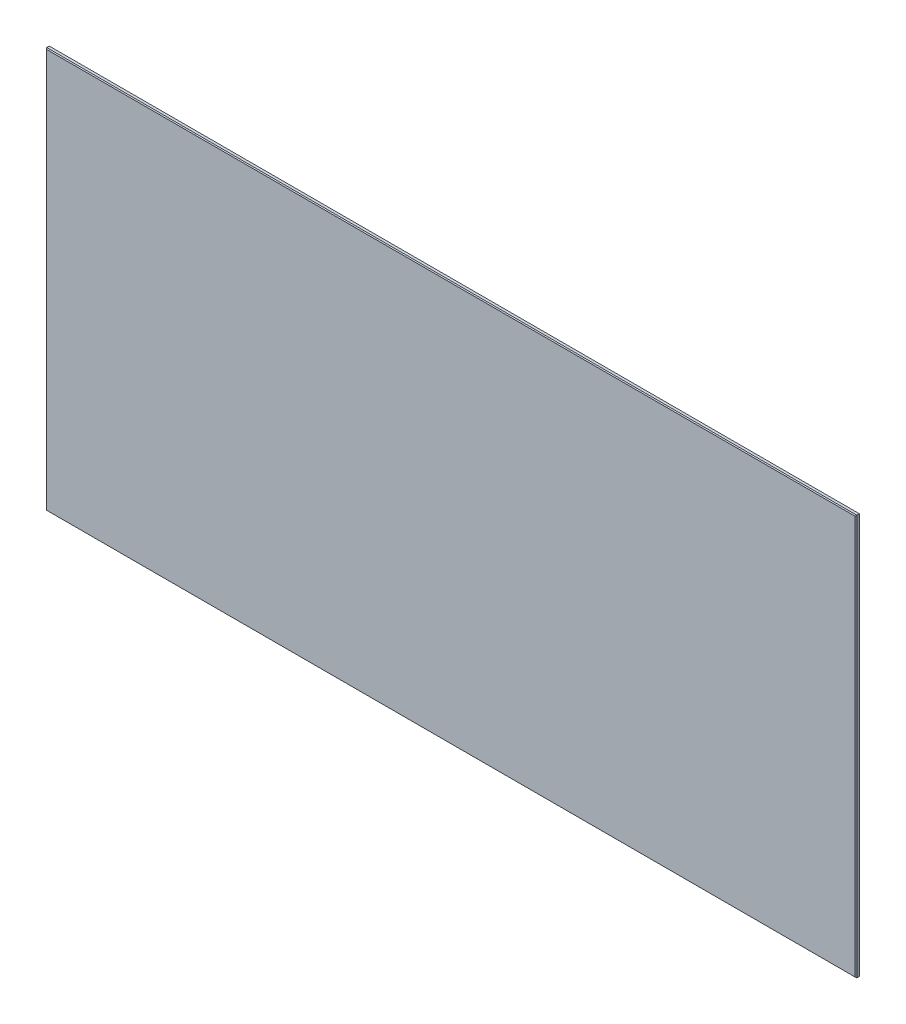
ISO-10303-21;
HEADER;
FILE_DESCRIPTION(('STEP AP214'),'2;1');
FILE_NAME('part.step','',(''),(''),'','','');
FILE_SCHEMA(('AUTOMOTIVE_DESIGN { 1 0 10303 214 1 1 1 1 }'));
ENDSEC;
DATA;
#1=APPLICATION_CONTEXT('core data for automotive mechanical design processes');
#2=APPLICATION_PROTOCOL_DEFINITION('international standard','automotive_design',2000,#1);
#3=PRODUCT_CONTEXT('',#1,'mechanical');
#4=PRODUCT('Part','Part','',(#3));
#5=PRODUCT_RELATED_PRODUCT_CATEGORY('part','',(#4));
#6=PRODUCT_DEFINITION_FORMATION('','',#4);
#7=PRODUCT_DEFINITION_CONTEXT('part definition',#1,'design');
#8=PRODUCT_DEFINITION('design','',#6,#7);
#9=PRODUCT_DEFINITION_SHAPE('','',#8);
#10=(LENGTH_UNIT() NAMED_UNIT(*) SI_UNIT(.MILLI.,.METRE.));
#11=(NAMED_UNIT(*) PLANE_ANGLE_UNIT() SI_UNIT($,.RADIAN.));
#12=(NAMED_UNIT(*) SI_UNIT($,.STERADIAN.) SOLID_ANGLE_UNIT());
#13=UNCERTAINTY_MEASURE_WITH_UNIT(LENGTH_MEASURE(1.E-05),#10,'distance_accuracy_value','');
#14=(GEOMETRIC_REPRESENTATION_CONTEXT(3) GLOBAL_UNCERTAINTY_ASSIGNED_CONTEXT((#13)) GLOBAL_UNIT_ASSIGNED_CONTEXT((#10,
#11,#12)) REPRESENTATION_CONTEXT('',''));
#15=CARTESIAN_POINT('',(0.,0.,0.));
#16=DIRECTION('',(0.,0.,1.));
#17=DIRECTION('',(1.,0.,0.));
#18=AXIS2_PLACEMENT_3D('',#15,#16,#17);
#19=CARTESIAN_POINT('',(603.25,298.45,1.905));
#20=DIRECTION('',(0.,-0.707106781186549,-0.707106781186545));
#21=DIRECTION('',(0.,0.707106781186546,-0.70710678118655));
#22=AXIS2_PLACEMENT_3D('',#19,#20,#21);
#23=PLANE('',#22);
#24=DIRECTION('',(-1.,0.,0.));
#25=VECTOR('',#24,1.);
#26=CARTESIAN_POINT('',(603.25,298.45,1.905));
#27=LINE('',#26,#25);
#28=CARTESIAN_POINT('',(603.25,298.45,1.905));
#29=VERTEX_POINT('',#28);
#30=CARTESIAN_POINT('',(-603.25,298.45,1.905));
#31=VERTEX_POINT('',#30);
#32=EDGE_CURVE('E203',#29,#31,#27,.T.);
#33=ORIENTED_EDGE('',*,*,#32,.T.);
#34=DIRECTION('',(-0.57735026918966,0.577350269189607,-0.57735026918961));
#35=VECTOR('',#34,1.);
#36=CARTESIAN_POINT('',(-601.98,297.18,3.175));
#37=LINE('',#36,#35);
#38=CARTESIAN_POINT('',(-601.98,297.18,3.175));
#39=VERTEX_POINT('',#38);
#40=EDGE_CURVE('E135',#31,#39,#37,.F.);
#41=ORIENTED_EDGE('',*,*,#40,.T.);
#42=DIRECTION('',(-1.,0.,0.));
#43=VECTOR('',#42,1.);
#44=CARTESIAN_POINT('',(603.25,297.18,3.175));
#45=LINE('',#44,#43);
#46=CARTESIAN_POINT('',(601.98,297.18,3.175));
#47=VERTEX_POINT('',#46);
#48=EDGE_CURVE('E168',#47,#39,#45,.T.);
#49=ORIENTED_EDGE('',*,*,#48,.F.);
#50=DIRECTION('',(0.577350269189627,0.577350269189624,-0.577350269189627));
#51=VECTOR('',#50,1.);
#52=CARTESIAN_POINT('',(503.766666666667,198.966666666667,101.388333333333));
#53=LINE('',#52,#51);
#54=EDGE_CURVE('E110',#47,#29,#53,.T.);
#55=ORIENTED_EDGE('',*,*,#54,.T.);
#56=EDGE_LOOP('',(#33,#41,#49,#55));
#57=FACE_BOUND('',#56,.T.);
#58=ADVANCED_FACE('F40',(#57),#23,.F.);
#59=CARTESIAN_POINT('',(603.25,297.18,3.175));
#60=DIRECTION('',(0.,0.,-1.));
#61=DIRECTION('',(-1.,0.,0.));
#62=AXIS2_PLACEMENT_3D('',#59,#60,#61);
#63=PLANE('',#62);
#64=ORIENTED_EDGE('',*,*,#48,.T.);
#65=DIRECTION('',(0.,-1.,0.));
#66=VECTOR('',#65,1.);
#67=CARTESIAN_POINT('',(-601.98,297.18,3.175));
#68=LINE('',#67,#66);
#69=CARTESIAN_POINT('',(-601.98,-297.18,3.175));
#70=VERTEX_POINT('',#69);
#71=EDGE_CURVE('E149',#39,#70,#68,.T.);
#72=ORIENTED_EDGE('',*,*,#71,.T.);
#73=DIRECTION('',(-1.,0.,0.));
#74=VECTOR('',#73,1.);
#75=CARTESIAN_POINT('',(603.25,-297.18,3.175));
#76=LINE('',#75,#74);
#77=CARTESIAN_POINT('',(601.98,-297.18,3.175));
#78=VERTEX_POINT('',#77);
#79=EDGE_CURVE('E109',#78,#70,#76,.T.);
#80=ORIENTED_EDGE('',*,*,#79,.F.);
#81=DIRECTION('',(0.,1.,0.));
#82=VECTOR('',#81,1.);
#83=CARTESIAN_POINT('',(601.98,297.18,3.175));
#84=LINE('',#83,#82);
#85=EDGE_CURVE('E147',#78,#47,#84,.T.);
#86=ORIENTED_EDGE('',*,*,#85,.T.);
#87=EDGE_LOOP('',(#64,#72,#80,#86));
#88=FACE_BOUND('',#87,.T.);
#89=ADVANCED_FACE('F167',(#88),#63,.F.);
#90=CARTESIAN_POINT('',(603.25,-297.18,3.175));
#91=DIRECTION('',(0.,0.707106781186565,-0.70710678118653));
#92=DIRECTION('',(0.,0.70710678118653,0.707106781186565));
#93=AXIS2_PLACEMENT_3D('',#90,#91,#92);
#94=PLANE('',#93);
#95=ORIENTED_EDGE('',*,*,#79,.T.);
#96=DIRECTION('',(0.577350269189669,0.57735026918959,0.577350269189618));
#97=VECTOR('',#96,1.);
#98=CARTESIAN_POINT('',(-403.859999999997,-99.0600000000244,201.294999999985));
#99=LINE('',#98,#97);
#100=CARTESIAN_POINT('',(-603.25,-298.45,1.905));
#101=VERTEX_POINT('',#100);
#102=EDGE_CURVE('E56',#70,#101,#99,.F.);
#103=ORIENTED_EDGE('',*,*,#102,.T.);
#104=DIRECTION('',(-1.,0.,0.));
#105=VECTOR('',#104,1.);
#106=CARTESIAN_POINT('',(603.25,-298.45,1.905));
#107=LINE('',#106,#105);
#108=CARTESIAN_POINT('',(603.25,-298.45,1.905));
#109=VERTEX_POINT('',#108);
#110=EDGE_CURVE('E107',#109,#101,#107,.T.);
#111=ORIENTED_EDGE('',*,*,#110,.F.);
#112=DIRECTION('',(-0.577350269189635,0.577350269189607,0.577350269189635));
#113=VECTOR('',#112,1.);
#114=CARTESIAN_POINT('',(503.766666666669,-198.966666666673,101.388333333332));
#115=LINE('',#114,#113);
#116=EDGE_CURVE('E64',#109,#78,#115,.T.);
#117=ORIENTED_EDGE('',*,*,#116,.T.);
#118=EDGE_LOOP('',(#95,#103,#111,#117));
#119=FACE_BOUND('',#118,.T.);
#120=ADVANCED_FACE('F106',(#119),#94,.F.);
#121=CARTESIAN_POINT('',(603.25,-298.45,1.905));
#122=DIRECTION('',(0.,1.,0.));
#123=DIRECTION('',(0.,0.,1.));
#124=AXIS2_PLACEMENT_3D('',#121,#122,#123);
#125=PLANE('',#124);
#126=ORIENTED_EDGE('',*,*,#110,.T.);
#127=DIRECTION('',(0.,0.,-1.));
#128=VECTOR('',#127,1.);
#129=CARTESIAN_POINT('',(-603.25,-298.45,1.905));
#130=LINE('',#129,#128);
#131=CARTESIAN_POINT('',(-603.25,-298.45,-1.90500000000007));
#132=VERTEX_POINT('',#131);
#133=EDGE_CURVE('E117',#101,#132,#130,.T.);
#134=ORIENTED_EDGE('',*,*,#133,.T.);
#135=DIRECTION('',(-1.,0.,0.));
#136=VECTOR('',#135,1.);
#137=CARTESIAN_POINT('',(603.25,-298.45,-1.90500000000007));
#138=LINE('',#137,#136);
#139=CARTESIAN_POINT('',(603.25,-298.45,-1.90500000000007));
#140=VERTEX_POINT('',#139);
#141=EDGE_CURVE('E121',#140,#132,#138,.T.);
#142=ORIENTED_EDGE('',*,*,#141,.F.);
#143=DIRECTION('',(0.,0.,-1.));
#144=VECTOR('',#143,1.);
#145=CARTESIAN_POINT('',(603.25,-298.45,1.905));
#146=LINE('',#145,#144);
#147=EDGE_CURVE('E120',#109,#140,#146,.T.);
#148=ORIENTED_EDGE('',*,*,#147,.F.);
#149=EDGE_LOOP('',(#126,#134,#142,#148));
#150=FACE_BOUND('',#149,.T.);
#151=ADVANCED_FACE('F115',(#150),#125,.F.);
#152=CARTESIAN_POINT('',(603.25,-298.45,-1.90500000000007));
#153=DIRECTION('',(0.,0.707106781186565,0.70710678118653));
#154=DIRECTION('',(0.,-0.70710678118653,0.707106781186565));
#155=AXIS2_PLACEMENT_3D('',#152,#153,#154);
#156=PLANE('',#155);
#157=ORIENTED_EDGE('',*,*,#141,.T.);
#158=DIRECTION('',(-0.577350269189669,-0.57735026918959,0.577350269189618));
#159=VECTOR('',#158,1.);
#160=CARTESIAN_POINT('',(-601.98,-297.18,-3.17500000000007));
#161=LINE('',#160,#159);
#162=CARTESIAN_POINT('',(-601.98,-297.18,-3.17500000000007));
#163=VERTEX_POINT('',#162);
#164=EDGE_CURVE('E145',#132,#163,#161,.F.);
#165=ORIENTED_EDGE('',*,*,#164,.T.);
#166=DIRECTION('',(-1.,0.,0.));
#167=VECTOR('',#166,1.);
#168=CARTESIAN_POINT('',(603.25,-297.18,-3.17500000000007));
#169=LINE('',#168,#167);
#170=CARTESIAN_POINT('',(601.98,-297.18,-3.17500000000007));
#171=VERTEX_POINT('',#170);
#172=EDGE_CURVE('E193',#171,#163,#169,.T.);
#173=ORIENTED_EDGE('',*,*,#172,.F.);
#174=DIRECTION('',(0.577350269189635,-0.577350269189607,0.577350269189635));
#175=VECTOR('',#174,1.);
#176=CARTESIAN_POINT('',(503.766666666669,-198.966666666673,-101.388333333332));
#177=LINE('',#176,#175);
#178=EDGE_CURVE('E138',#171,#140,#177,.T.);
#179=ORIENTED_EDGE('',*,*,#178,.T.);
#180=EDGE_LOOP('',(#157,#165,#173,#179));
#181=FACE_BOUND('',#180,.T.);
#182=ADVANCED_FACE('F198',(#181),#156,.F.);
#183=CARTESIAN_POINT('',(603.25,-297.18,-3.17500000000007));
#184=DIRECTION('',(0.,0.,1.));
#185=DIRECTION('',(0.,-1.,0.));
#186=AXIS2_PLACEMENT_3D('',#183,#184,#185);
#187=PLANE('',#186);
#188=ORIENTED_EDGE('',*,*,#172,.T.);
#189=DIRECTION('',(0.,1.,0.));
#190=VECTOR('',#189,1.);
#191=CARTESIAN_POINT('',(-601.98,-297.18,-3.17500000000007));
#192=LINE('',#191,#190);
#193=CARTESIAN_POINT('',(-601.98,297.18,-3.175));
#194=VERTEX_POINT('',#193);
#195=EDGE_CURVE('E172',#163,#194,#192,.T.);
#196=ORIENTED_EDGE('',*,*,#195,.T.);
#197=DIRECTION('',(-1.,0.,0.));
#198=VECTOR('',#197,1.);
#199=CARTESIAN_POINT('',(603.25,297.18,-3.175));
#200=LINE('',#199,#198);
#201=CARTESIAN_POINT('',(601.98,297.18,-3.175));
#202=VERTEX_POINT('',#201);
#203=EDGE_CURVE('E182',#202,#194,#200,.T.);
#204=ORIENTED_EDGE('',*,*,#203,.F.);
#205=DIRECTION('',(0.,-1.,0.));
#206=VECTOR('',#205,1.);
#207=CARTESIAN_POINT('',(601.98,-297.18,-3.17500000000007));
#208=LINE('',#207,#206);
#209=EDGE_CURVE('E170',#202,#171,#208,.T.);
#210=ORIENTED_EDGE('',*,*,#209,.T.);
#211=EDGE_LOOP('',(#188,#196,#204,#210));
#212=FACE_BOUND('',#211,.T.);
#213=ADVANCED_FACE('F190',(#212),#187,.F.);
#214=CARTESIAN_POINT('',(603.25,297.18,-3.175));
#215=DIRECTION('',(0.,-0.707106781186549,0.707106781186546));
#216=DIRECTION('',(0.,-0.707106781186546,-0.707106781186549));
#217=AXIS2_PLACEMENT_3D('',#214,#215,#216);
#218=PLANE('',#217);
#219=ORIENTED_EDGE('',*,*,#203,.T.);
#220=DIRECTION('',(0.57735026918966,-0.577350269189607,-0.57735026918961));
#221=VECTOR('',#220,1.);
#222=CARTESIAN_POINT('',(-403.859999999994,99.0600000000131,-201.294999999988));
#223=LINE('',#222,#221);
#224=CARTESIAN_POINT('',(-603.25,298.45,-1.905));
#225=VERTEX_POINT('',#224);
#226=EDGE_CURVE('E136',#194,#225,#223,.F.);
#227=ORIENTED_EDGE('',*,*,#226,.T.);
#228=DIRECTION('',(-1.,0.,0.));
#229=VECTOR('',#228,1.);
#230=CARTESIAN_POINT('',(603.25,298.45,-1.905));
#231=LINE('',#230,#229);
#232=CARTESIAN_POINT('',(603.25,298.45,-1.905));
#233=VERTEX_POINT('',#232);
#234=EDGE_CURVE('E184',#233,#225,#231,.T.);
#235=ORIENTED_EDGE('',*,*,#234,.F.);
#236=DIRECTION('',(-0.577350269189627,-0.577350269189624,-0.577350269189627));
#237=VECTOR('',#236,1.);
#238=CARTESIAN_POINT('',(503.766666666667,198.966666666667,-101.388333333333));
#239=LINE('',#238,#237);
#240=EDGE_CURVE('E140',#233,#202,#239,.T.);
#241=ORIENTED_EDGE('',*,*,#240,.T.);
#242=EDGE_LOOP('',(#219,#227,#235,#241));
#243=FACE_BOUND('',#242,.T.);
#244=ADVANCED_FACE('F181',(#243),#218,.F.);
#245=CARTESIAN_POINT('',(603.25,298.45,-1.905));
#246=DIRECTION('',(0.,-1.,0.));
#247=DIRECTION('',(0.,0.,-1.));
#248=AXIS2_PLACEMENT_3D('',#245,#246,#247);
#249=PLANE('',#248);
#250=ORIENTED_EDGE('',*,*,#234,.T.);
#251=DIRECTION('',(0.,0.,1.));
#252=VECTOR('',#251,1.);
#253=CARTESIAN_POINT('',(-603.25,298.45,-1.905));
#254=LINE('',#253,#252);
#255=EDGE_CURVE('E131',#225,#31,#254,.T.);
#256=ORIENTED_EDGE('',*,*,#255,.T.);
#257=ORIENTED_EDGE('',*,*,#32,.F.);
#258=DIRECTION('',(0.,0.,1.));
#259=VECTOR('',#258,1.);
#260=CARTESIAN_POINT('',(603.25,298.45,-1.905));
#261=LINE('',#260,#259);
#262=EDGE_CURVE('E159',#233,#29,#261,.T.);
#263=ORIENTED_EDGE('',*,*,#262,.F.);
#264=EDGE_LOOP('',(#250,#256,#257,#263));
#265=FACE_BOUND('',#264,.T.);
#266=ADVANCED_FACE('F209',(#265),#249,.F.);
#267=CARTESIAN_POINT('',(603.25,0.,0.));
#268=DIRECTION('',(1.,0.,0.));
#269=DIRECTION('',(0.,0.,-1.));
#270=AXIS2_PLACEMENT_3D('',#267,#268,#269);
#271=PLANE('',#270);
#272=ORIENTED_EDGE('',*,*,#147,.T.);
#273=DIRECTION('',(0.,1.,0.));
#274=VECTOR('',#273,1.);
#275=CARTESIAN_POINT('',(603.25,297.18,-1.90500000000012));
#276=LINE('',#275,#274);
#277=EDGE_CURVE('E11',#140,#233,#276,.T.);
#278=ORIENTED_EDGE('',*,*,#277,.T.);
#279=ORIENTED_EDGE('',*,*,#262,.T.);
#280=DIRECTION('',(0.,-1.,0.));
#281=VECTOR('',#280,1.);
#282=CARTESIAN_POINT('',(603.25,-297.18,1.90500000000012));
#283=LINE('',#282,#281);
#284=EDGE_CURVE('E49',#29,#109,#283,.T.);
#285=ORIENTED_EDGE('',*,*,#284,.T.);
#286=EDGE_LOOP('',(#272,#278,#279,#285));
#287=FACE_BOUND('',#286,.T.);
#288=ADVANCED_FACE('F157',(#287),#271,.T.);
#289=CARTESIAN_POINT('',(-603.25,0.,0.));
#290=DIRECTION('',(1.,0.,0.));
#291=DIRECTION('',(0.,0.,-1.));
#292=AXIS2_PLACEMENT_3D('',#289,#290,#291);
#293=PLANE('',#292);
#294=ORIENTED_EDGE('',*,*,#255,.F.);
#295=DIRECTION('',(0.,-1.,0.));
#296=VECTOR('',#295,1.);
#297=CARTESIAN_POINT('',(-603.25,0.,-1.90500000000004));
#298=LINE('',#297,#296);
#299=EDGE_CURVE('E129',#225,#132,#298,.T.);
#300=ORIENTED_EDGE('',*,*,#299,.T.);
#301=ORIENTED_EDGE('',*,*,#133,.F.);
#302=DIRECTION('',(0.,1.,0.));
#303=VECTOR('',#302,1.);
#304=CARTESIAN_POINT('',(-603.25,0.,1.90500000000001));
#305=LINE('',#304,#303);
#306=EDGE_CURVE('E126',#101,#31,#305,.T.);
#307=ORIENTED_EDGE('',*,*,#306,.T.);
#308=EDGE_LOOP('',(#294,#300,#301,#307));
#309=FACE_BOUND('',#308,.T.);
#310=ADVANCED_FACE('F125',(#309),#293,.F.);
#311=CARTESIAN_POINT('',(-601.98,-297.18,-3.17500000000007));
#312=DIRECTION('',(0.707106781186517,0.,0.707106781186579));
#313=DIRECTION('',(0.,1.,0.));
#314=AXIS2_PLACEMENT_3D('',#311,#312,#313);
#315=PLANE('',#314);
#316=ORIENTED_EDGE('',*,*,#164,.F.);
#317=ORIENTED_EDGE('',*,*,#299,.F.);
#318=ORIENTED_EDGE('',*,*,#226,.F.);
#319=ORIENTED_EDGE('',*,*,#195,.F.);
#320=EDGE_LOOP('',(#316,#317,#318,#319));
#321=FACE_BOUND('',#320,.T.);
#322=ADVANCED_FACE('F211',(#321),#315,.F.);
#323=CARTESIAN_POINT('',(-601.98,297.18,3.175));
#324=DIRECTION('',(0.707106781186517,0.,-0.707106781186579));
#325=DIRECTION('',(0.,-1.,0.));
#326=AXIS2_PLACEMENT_3D('',#323,#324,#325);
#327=PLANE('',#326);
#328=ORIENTED_EDGE('',*,*,#40,.F.);
#329=ORIENTED_EDGE('',*,*,#306,.F.);
#330=ORIENTED_EDGE('',*,*,#102,.F.);
#331=ORIENTED_EDGE('',*,*,#71,.F.);
#332=EDGE_LOOP('',(#328,#329,#330,#331));
#333=FACE_BOUND('',#332,.T.);
#334=ADVANCED_FACE('F134',(#333),#327,.F.);
#335=CARTESIAN_POINT('',(603.25,0.,-1.90500000000015));
#336=DIRECTION('',(0.707106781186548,0.,-0.707106781186548));
#337=DIRECTION('',(0.,-1.,0.));
#338=AXIS2_PLACEMENT_3D('',#335,#336,#337);
#339=PLANE('',#338);
#340=ORIENTED_EDGE('',*,*,#178,.F.);
#341=ORIENTED_EDGE('',*,*,#209,.F.);
#342=ORIENTED_EDGE('',*,*,#240,.F.);
#343=ORIENTED_EDGE('',*,*,#277,.F.);
#344=EDGE_LOOP('',(#340,#341,#342,#343));
#345=FACE_BOUND('',#344,.T.);
#346=ADVANCED_FACE('F196',(#345),#339,.T.);
#347=CARTESIAN_POINT('',(603.25,0.,1.90500000000012));
#348=DIRECTION('',(0.707106781186548,0.,0.707106781186548));
#349=DIRECTION('',(0.,1.,0.));
#350=AXIS2_PLACEMENT_3D('',#347,#348,#349);
#351=PLANE('',#350);
#352=ORIENTED_EDGE('',*,*,#54,.F.);
#353=ORIENTED_EDGE('',*,*,#85,.F.);
#354=ORIENTED_EDGE('',*,*,#116,.F.);
#355=ORIENTED_EDGE('',*,*,#284,.F.);
#356=EDGE_LOOP('',(#352,#353,#354,#355));
#357=FACE_BOUND('',#356,.T.);
#358=ADVANCED_FACE('F43',(#357),#351,.T.);
#359=CLOSED_SHELL('',(#58,#89,#120,#151,#182,#213,#244,#266,#288,#310,#322,#334,#346,#358));
#360=MANIFOLD_SOLID_BREP('B2',#359);
#361=ADVANCED_BREP_SHAPE_REPRESENTATION('',(#18,#360),#14);
#362=SHAPE_DEFINITION_REPRESENTATION(#9,#361);
ENDSEC;
END-ISO-10303-21;
